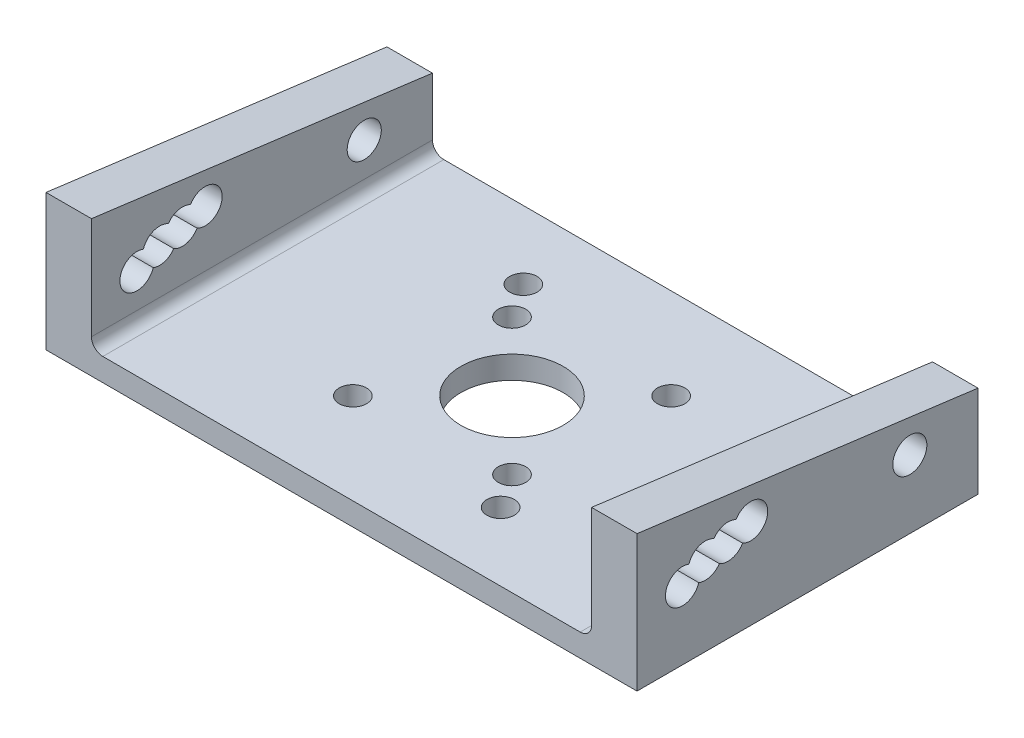
ISO-10303-21;
HEADER;
FILE_DESCRIPTION(('STEP AP214'),'2;1');
FILE_NAME('part.step','',(''),(''),'','','');
FILE_SCHEMA(('AUTOMOTIVE_DESIGN { 1 0 10303 214 1 1 1 1 }'));
ENDSEC;
DATA;
#1=APPLICATION_CONTEXT('core data for automotive mechanical design processes');
#2=APPLICATION_PROTOCOL_DEFINITION('international standard','automotive_design',2000,#1);
#3=PRODUCT_CONTEXT('',#1,'mechanical');
#4=PRODUCT('Part','Part','',(#3));
#5=PRODUCT_RELATED_PRODUCT_CATEGORY('part','',(#4));
#6=PRODUCT_DEFINITION_FORMATION('','',#4);
#7=PRODUCT_DEFINITION_CONTEXT('part definition',#1,'design');
#8=PRODUCT_DEFINITION('design','',#6,#7);
#9=PRODUCT_DEFINITION_SHAPE('','',#8);
#10=(LENGTH_UNIT() NAMED_UNIT(*) SI_UNIT(.MILLI.,.METRE.));
#11=(NAMED_UNIT(*) PLANE_ANGLE_UNIT() SI_UNIT($,.RADIAN.));
#12=(NAMED_UNIT(*) SI_UNIT($,.STERADIAN.) SOLID_ANGLE_UNIT());
#13=UNCERTAINTY_MEASURE_WITH_UNIT(LENGTH_MEASURE(1.E-05),#10,'distance_accuracy_value','');
#14=(GEOMETRIC_REPRESENTATION_CONTEXT(3) GLOBAL_UNCERTAINTY_ASSIGNED_CONTEXT((#13)) GLOBAL_UNIT_ASSIGNED_CONTEXT((#10,
#11,#12)) REPRESENTATION_CONTEXT('',''));
#15=CARTESIAN_POINT('',(0.,0.,0.));
#16=DIRECTION('',(0.,0.,1.));
#17=DIRECTION('',(1.,0.,0.));
#18=AXIS2_PLACEMENT_3D('',#15,#16,#17);
#19=CARTESIAN_POINT('',(0.,2.,0.));
#20=DIRECTION('',(0.,-1.,0.));
#21=DIRECTION('',(0.,0.,-1.));
#22=AXIS2_PLACEMENT_3D('',#19,#20,#21);
#23=PLANE('',#22);
#24=CARTESIAN_POINT('',(6.,2.,6.));
#25=DIRECTION('',(0.,1.,0.));
#26=DIRECTION('',(0.,0.,1.));
#27=AXIS2_PLACEMENT_3D('',#24,#25,#26);
#28=CIRCLE('',#27,1.2058376326813);
#29=CARTESIAN_POINT('',(6.,2.,7.2058376326813));
#30=VERTEX_POINT('',#29);
#31=EDGE_CURVE('E326',#30,#30,#28,.T.);
#32=ORIENTED_EDGE('',*,*,#31,.F.);
#33=EDGE_LOOP('',(#32));
#34=FACE_BOUND('',#33,.T.);
#35=CARTESIAN_POINT('',(-8.,2.,-9.));
#36=DIRECTION('',(0.,1.,0.));
#37=DIRECTION('',(0.,0.,1.));
#38=AXIS2_PLACEMENT_3D('',#35,#36,#37);
#39=CIRCLE('',#38,1.2058376326813);
#40=CARTESIAN_POINT('',(-8.,2.,-7.79416236731869));
#41=VERTEX_POINT('',#40);
#42=EDGE_CURVE('E338',#41,#41,#39,.T.);
#43=ORIENTED_EDGE('',*,*,#42,.F.);
#44=EDGE_LOOP('',(#43));
#45=FACE_BOUND('',#44,.T.);
#46=CARTESIAN_POINT('',(7.,2.,-7.));
#47=DIRECTION('',(0.,1.,0.));
#48=DIRECTION('',(0.,0.,1.));
#49=AXIS2_PLACEMENT_3D('',#46,#47,#48);
#50=CIRCLE('',#49,1.20583763268131);
#51=CARTESIAN_POINT('',(7.,2.,-5.79416236731869));
#52=VERTEX_POINT('',#51);
#53=EDGE_CURVE('E350',#52,#52,#50,.T.);
#54=ORIENTED_EDGE('',*,*,#53,.F.);
#55=EDGE_LOOP('',(#54));
#56=FACE_BOUND('',#55,.T.);
#57=CARTESIAN_POINT('',(0.,2.,0.));
#58=DIRECTION('',(0.,1.,0.));
#59=DIRECTION('',(0.,0.,1.));
#60=AXIS2_PLACEMENT_3D('',#57,#58,#59);
#61=CIRCLE('',#60,4.5);
#62=CARTESIAN_POINT('',(0.,2.,4.5));
#63=VERTEX_POINT('',#62);
#64=EDGE_CURVE('E356',#63,#63,#61,.T.);
#65=ORIENTED_EDGE('',*,*,#64,.F.);
#66=EDGE_LOOP('',(#65));
#67=FACE_BOUND('',#66,.T.);
#68=CARTESIAN_POINT('',(-6.,2.,-6.));
#69=DIRECTION('',(0.,1.,0.));
#70=DIRECTION('',(0.,0.,1.));
#71=AXIS2_PLACEMENT_3D('',#68,#69,#70);
#72=CIRCLE('',#71,1.2058376326813);
#73=CARTESIAN_POINT('',(-6.,2.,-4.7941623673187));
#74=VERTEX_POINT('',#73);
#75=EDGE_CURVE('E344',#74,#74,#72,.T.);
#76=ORIENTED_EDGE('',*,*,#75,.F.);
#77=EDGE_LOOP('',(#76));
#78=FACE_BOUND('',#77,.T.);
#79=CARTESIAN_POINT('',(-7.,2.,7.));
#80=DIRECTION('',(0.,1.,0.));
#81=DIRECTION('',(0.,0.,1.));
#82=AXIS2_PLACEMENT_3D('',#79,#80,#81);
#83=CIRCLE('',#82,1.2058376326813);
#84=CARTESIAN_POINT('',(-7.,2.,8.2058376326813));
#85=VERTEX_POINT('',#84);
#86=EDGE_CURVE('E332',#85,#85,#83,.T.);
#87=ORIENTED_EDGE('',*,*,#86,.F.);
#88=EDGE_LOOP('',(#87));
#89=FACE_BOUND('',#88,.T.);
#90=CARTESIAN_POINT('',(8.,2.,9.));
#91=DIRECTION('',(0.,1.,0.));
#92=DIRECTION('',(0.,0.,1.));
#93=AXIS2_PLACEMENT_3D('',#90,#91,#92);
#94=CIRCLE('',#93,1.20583763268131);
#95=CARTESIAN_POINT('',(8.,2.,10.2058376326813));
#96=VERTEX_POINT('',#95);
#97=EDGE_CURVE('E320',#96,#96,#94,.T.);
#98=ORIENTED_EDGE('',*,*,#97,.F.);
#99=EDGE_LOOP('',(#98));
#100=FACE_BOUND('',#99,.T.);
#101=DIRECTION('',(1.,0.,0.));
#102=VECTOR('',#101,1.);
#103=CARTESIAN_POINT('',(-26.,2.,15.));
#104=LINE('',#103,#102);
#105=CARTESIAN_POINT('',(-21.,2.,15.));
#106=VERTEX_POINT('',#105);
#107=CARTESIAN_POINT('',(21.,2.,15.));
#108=VERTEX_POINT('',#107);
#109=EDGE_CURVE('E371',#106,#108,#104,.T.);
#110=ORIENTED_EDGE('',*,*,#109,.T.);
#111=DIRECTION('',(0.,0.,-1.));
#112=VECTOR('',#111,1.);
#113=CARTESIAN_POINT('',(21.,2.,-15.));
#114=LINE('',#113,#112);
#115=CARTESIAN_POINT('',(21.,2.,-15.));
#116=VERTEX_POINT('',#115);
#117=EDGE_CURVE('E380',#108,#116,#114,.T.);
#118=ORIENTED_EDGE('',*,*,#117,.T.);
#119=DIRECTION('',(-1.,0.,0.));
#120=VECTOR('',#119,1.);
#121=CARTESIAN_POINT('',(-26.,2.,-15.));
#122=LINE('',#121,#120);
#123=CARTESIAN_POINT('',(-21.,2.,-15.));
#124=VERTEX_POINT('',#123);
#125=EDGE_CURVE('E367',#116,#124,#122,.T.);
#126=ORIENTED_EDGE('',*,*,#125,.T.);
#127=DIRECTION('',(0.,0.,-1.));
#128=VECTOR('',#127,1.);
#129=CARTESIAN_POINT('',(-21.,2.,15.));
#130=LINE('',#129,#128);
#131=EDGE_CURVE('E378',#124,#106,#130,.F.);
#132=ORIENTED_EDGE('',*,*,#131,.T.);
#133=EDGE_LOOP('',(#110,#118,#126,#132));
#134=FACE_BOUND('',#133,.T.);
#135=ADVANCED_FACE('F35',(#34,#45,#56,#67,#78,#89,#100,#134),#23,.F.);
#136=CARTESIAN_POINT('',(0.,0.,0.));
#137=DIRECTION('',(0.,-1.,0.));
#138=DIRECTION('',(0.,0.,-1.));
#139=AXIS2_PLACEMENT_3D('',#136,#137,#138);
#140=PLANE('',#139);
#141=CARTESIAN_POINT('',(6.,0.,6.));
#142=DIRECTION('',(0.,1.,0.));
#143=DIRECTION('',(0.,0.,1.));
#144=AXIS2_PLACEMENT_3D('',#141,#142,#143);
#145=CIRCLE('',#144,1.2058376326813);
#146=CARTESIAN_POINT('',(6.,0.,7.2058376326813));
#147=VERTEX_POINT('',#146);
#148=EDGE_CURVE('E323',#147,#147,#145,.T.);
#149=ORIENTED_EDGE('',*,*,#148,.T.);
#150=EDGE_LOOP('',(#149));
#151=FACE_BOUND('',#150,.T.);
#152=CARTESIAN_POINT('',(-8.,0.,-9.));
#153=DIRECTION('',(0.,1.,0.));
#154=DIRECTION('',(0.,0.,1.));
#155=AXIS2_PLACEMENT_3D('',#152,#153,#154);
#156=CIRCLE('',#155,1.2058376326813);
#157=CARTESIAN_POINT('',(-8.,0.,-7.79416236731869));
#158=VERTEX_POINT('',#157);
#159=EDGE_CURVE('E335',#158,#158,#156,.T.);
#160=ORIENTED_EDGE('',*,*,#159,.T.);
#161=EDGE_LOOP('',(#160));
#162=FACE_BOUND('',#161,.T.);
#163=CARTESIAN_POINT('',(7.,0.,-7.));
#164=DIRECTION('',(0.,1.,0.));
#165=DIRECTION('',(0.,0.,1.));
#166=AXIS2_PLACEMENT_3D('',#163,#164,#165);
#167=CIRCLE('',#166,1.20583763268131);
#168=CARTESIAN_POINT('',(7.,0.,-5.79416236731869));
#169=VERTEX_POINT('',#168);
#170=EDGE_CURVE('E347',#169,#169,#167,.T.);
#171=ORIENTED_EDGE('',*,*,#170,.T.);
#172=EDGE_LOOP('',(#171));
#173=FACE_BOUND('',#172,.T.);
#174=DIRECTION('',(0.,0.,-1.));
#175=VECTOR('',#174,1.);
#176=CARTESIAN_POINT('',(26.,0.,15.));
#177=LINE('',#176,#175);
#178=CARTESIAN_POINT('',(26.,0.,15.));
#179=VERTEX_POINT('',#178);
#180=CARTESIAN_POINT('',(26.,0.,-15.));
#181=VERTEX_POINT('',#180);
#182=EDGE_CURVE('E359',#179,#181,#177,.T.);
#183=ORIENTED_EDGE('',*,*,#182,.F.);
#184=DIRECTION('',(1.,0.,0.));
#185=VECTOR('',#184,1.);
#186=CARTESIAN_POINT('',(-26.,0.,15.));
#187=LINE('',#186,#185);
#188=CARTESIAN_POINT('',(-26.,0.,15.));
#189=VERTEX_POINT('',#188);
#190=EDGE_CURVE('E372',#189,#179,#187,.T.);
#191=ORIENTED_EDGE('',*,*,#190,.F.);
#192=DIRECTION('',(0.,0.,1.));
#193=VECTOR('',#192,1.);
#194=CARTESIAN_POINT('',(-26.,0.,15.));
#195=LINE('',#194,#193);
#196=CARTESIAN_POINT('',(-26.,0.,-15.));
#197=VERTEX_POINT('',#196);
#198=EDGE_CURVE('E438',#197,#189,#195,.T.);
#199=ORIENTED_EDGE('',*,*,#198,.F.);
#200=DIRECTION('',(-1.,0.,0.));
#201=VECTOR('',#200,1.);
#202=CARTESIAN_POINT('',(-26.,0.,-15.));
#203=LINE('',#202,#201);
#204=EDGE_CURVE('E440',#181,#197,#203,.T.);
#205=ORIENTED_EDGE('',*,*,#204,.F.);
#206=EDGE_LOOP('',(#183,#191,#199,#205));
#207=FACE_BOUND('',#206,.T.);
#208=CARTESIAN_POINT('',(0.,0.,0.));
#209=DIRECTION('',(0.,1.,0.));
#210=DIRECTION('',(0.,0.,1.));
#211=AXIS2_PLACEMENT_3D('',#208,#209,#210);
#212=CIRCLE('',#211,4.5);
#213=CARTESIAN_POINT('',(0.,0.,4.5));
#214=VERTEX_POINT('',#213);
#215=EDGE_CURVE('E353',#214,#214,#212,.T.);
#216=ORIENTED_EDGE('',*,*,#215,.T.);
#217=EDGE_LOOP('',(#216));
#218=FACE_BOUND('',#217,.T.);
#219=CARTESIAN_POINT('',(-6.,0.,-6.));
#220=DIRECTION('',(0.,1.,0.));
#221=DIRECTION('',(0.,0.,1.));
#222=AXIS2_PLACEMENT_3D('',#219,#220,#221);
#223=CIRCLE('',#222,1.2058376326813);
#224=CARTESIAN_POINT('',(-6.,0.,-4.7941623673187));
#225=VERTEX_POINT('',#224);
#226=EDGE_CURVE('E341',#225,#225,#223,.T.);
#227=ORIENTED_EDGE('',*,*,#226,.T.);
#228=EDGE_LOOP('',(#227));
#229=FACE_BOUND('',#228,.T.);
#230=CARTESIAN_POINT('',(-7.,0.,7.));
#231=DIRECTION('',(0.,1.,0.));
#232=DIRECTION('',(0.,0.,1.));
#233=AXIS2_PLACEMENT_3D('',#230,#231,#232);
#234=CIRCLE('',#233,1.2058376326813);
#235=CARTESIAN_POINT('',(-7.,0.,8.2058376326813));
#236=VERTEX_POINT('',#235);
#237=EDGE_CURVE('E329',#236,#236,#234,.T.);
#238=ORIENTED_EDGE('',*,*,#237,.T.);
#239=EDGE_LOOP('',(#238));
#240=FACE_BOUND('',#239,.T.);
#241=CARTESIAN_POINT('',(8.,0.,9.));
#242=DIRECTION('',(0.,1.,0.));
#243=DIRECTION('',(0.,0.,1.));
#244=AXIS2_PLACEMENT_3D('',#241,#242,#243);
#245=CIRCLE('',#244,1.20583763268131);
#246=CARTESIAN_POINT('',(8.,0.,10.2058376326813));
#247=VERTEX_POINT('',#246);
#248=EDGE_CURVE('E297',#247,#247,#245,.T.);
#249=ORIENTED_EDGE('',*,*,#248,.T.);
#250=EDGE_LOOP('',(#249));
#251=FACE_BOUND('',#250,.T.);
#252=ADVANCED_FACE('F442',(#151,#162,#173,#207,#218,#229,#240,#251),#140,.T.);
#253=CARTESIAN_POINT('',(26.,2.,15.));
#254=DIRECTION('',(-1.,0.,0.));
#255=DIRECTION('',(0.,0.,1.));
#256=AXIS2_PLACEMENT_3D('',#253,#254,#255);
#257=PLANE('',#256);
#258=ORIENTED_EDGE('',*,*,#182,.T.);
#259=DIRECTION('',(0.,-1.,0.));
#260=VECTOR('',#259,1.);
#261=CARTESIAN_POINT('',(26.,2.,-15.));
#262=LINE('',#261,#260);
#263=CARTESIAN_POINT('',(26.,8.08944509942933,-15.));
#264=VERTEX_POINT('',#263);
#265=EDGE_CURVE('E381',#264,#181,#262,.T.);
#266=ORIENTED_EDGE('',*,*,#265,.F.);
#267=DIRECTION('',(0.,0.129258302982044,0.99161095753839));
#268=VECTOR('',#267,1.);
#269=CARTESIAN_POINT('',(26.,9.87689824947524,-1.28747176173078));
#270=LINE('',#269,#268);
#271=CARTESIAN_POINT('',(26.,12.,15.));
#272=VERTEX_POINT('',#271);
#273=EDGE_CURVE('E211',#264,#272,#270,.T.);
#274=ORIENTED_EDGE('',*,*,#273,.T.);
#275=DIRECTION('',(0.,-1.,0.));
#276=VECTOR('',#275,1.);
#277=CARTESIAN_POINT('',(26.,2.,15.));
#278=LINE('',#277,#276);
#279=EDGE_CURVE('E377',#272,#179,#278,.T.);
#280=ORIENTED_EDGE('',*,*,#279,.T.);
#281=EDGE_LOOP('',(#258,#266,#274,#280));
#282=FACE_BOUND('',#281,.T.);
#283=CARTESIAN_POINT('',(26.,6.,11.));
#284=DIRECTION('',(-1.,0.,0.));
#285=DIRECTION('',(0.,0.,1.));
#286=AXIS2_PLACEMENT_3D('',#283,#284,#285);
#287=CIRCLE('',#286,1.5);
#288=CARTESIAN_POINT('',(26.,5.55190263226596,9.568494237165));
#289=VERTEX_POINT('',#288);
#290=CARTESIAN_POINT('',(26.,7.38809736773404,10.431505762835));
#291=VERTEX_POINT('',#290);
#292=EDGE_CURVE('E232',#289,#291,#287,.T.);
#293=ORIENTED_EDGE('',*,*,#292,.T.);
#294=CARTESIAN_POINT('',(26.,6.94,9.));
#295=DIRECTION('',(-1.,0.,0.));
#296=DIRECTION('',(0.,0.,1.));
#297=AXIS2_PLACEMENT_3D('',#294,#295,#296);
#298=CIRCLE('',#297,1.5);
#299=CARTESIAN_POINT('',(26.,8.23344859091753,8.24040093295645));
#300=VERTEX_POINT('',#299);
#301=EDGE_CURVE('E188',#291,#300,#298,.T.);
#302=ORIENTED_EDGE('',*,*,#301,.T.);
#303=CARTESIAN_POINT('',(26.,7.39,7.));
#304=DIRECTION('',(-1.,0.,0.));
#305=DIRECTION('',(0.,0.,1.));
#306=AXIS2_PLACEMENT_3D('',#303,#304,#305);
#307=CIRCLE('',#306,1.5);
#308=CARTESIAN_POINT('',(26.,8.71231680996912,6.29184870679136));
#309=VERTEX_POINT('',#308);
#310=EDGE_CURVE('E235',#300,#309,#307,.T.);
#311=ORIENTED_EDGE('',*,*,#310,.T.);
#312=CARTESIAN_POINT('',(26.,7.95,5.));
#313=DIRECTION('',(-1.,0.,0.));
#314=DIRECTION('',(0.,0.,1.));
#315=AXIS2_PLACEMENT_3D('',#312,#313,#314);
#316=CIRCLE('',#315,1.5);
#317=CARTESIAN_POINT('',(26.,6.62768319003088,5.70815129320865));
#318=VERTEX_POINT('',#317);
#319=EDGE_CURVE('E239',#309,#318,#316,.T.);
#320=ORIENTED_EDGE('',*,*,#319,.T.);
#321=CARTESIAN_POINT('',(26.,6.09655140908246,7.75959906704356));
#322=VERTEX_POINT('',#321);
#323=EDGE_CURVE('E240',#318,#322,#307,.T.);
#324=ORIENTED_EDGE('',*,*,#323,.T.);
#325=EDGE_CURVE('E236',#322,#289,#298,.T.);
#326=ORIENTED_EDGE('',*,*,#325,.T.);
#327=EDGE_LOOP('',(#293,#302,#311,#320,#324,#326));
#328=FACE_BOUND('',#327,.T.);
#329=CARTESIAN_POINT('',(26.,6.,-9.));
#330=DIRECTION('',(-1.,0.,0.));
#331=DIRECTION('',(0.,0.,1.));
#332=AXIS2_PLACEMENT_3D('',#329,#330,#331);
#333=CIRCLE('',#332,1.5);
#334=CARTESIAN_POINT('',(26.,6.,-7.5));
#335=VERTEX_POINT('',#334);
#336=EDGE_CURVE('E214',#335,#335,#333,.T.);
#337=ORIENTED_EDGE('',*,*,#336,.T.);
#338=EDGE_LOOP('',(#337));
#339=FACE_BOUND('',#338,.T.);
#340=ADVANCED_FACE('F423',(#282,#328,#339),#257,.F.);
#341=CARTESIAN_POINT('',(-26.,2.,-15.));
#342=DIRECTION('',(0.,0.,1.));
#343=DIRECTION('',(1.,0.,0.));
#344=AXIS2_PLACEMENT_3D('',#341,#342,#343);
#345=PLANE('',#344);
#346=ORIENTED_EDGE('',*,*,#204,.T.);
#347=DIRECTION('',(0.,-1.,0.));
#348=VECTOR('',#347,1.);
#349=CARTESIAN_POINT('',(-26.,2.,-15.));
#350=LINE('',#349,#348);
#351=CARTESIAN_POINT('',(-26.,8.08944509942933,-15.));
#352=VERTEX_POINT('',#351);
#353=EDGE_CURVE('E427',#352,#197,#350,.T.);
#354=ORIENTED_EDGE('',*,*,#353,.F.);
#355=DIRECTION('',(-1.,0.,0.));
#356=VECTOR('',#355,1.);
#357=CARTESIAN_POINT('',(-22.,8.08944509942933,-15.));
#358=LINE('',#357,#356);
#359=CARTESIAN_POINT('',(-22.,8.08944509942933,-15.));
#360=VERTEX_POINT('',#359);
#361=EDGE_CURVE('E298',#360,#352,#358,.T.);
#362=ORIENTED_EDGE('',*,*,#361,.F.);
#363=DIRECTION('',(0.,1.,0.));
#364=VECTOR('',#363,1.);
#365=CARTESIAN_POINT('',(-22.,0.,-15.));
#366=LINE('',#365,#364);
#367=CARTESIAN_POINT('',(-22.,3.,-15.));
#368=VERTEX_POINT('',#367);
#369=EDGE_CURVE('E278',#368,#360,#366,.T.);
#370=ORIENTED_EDGE('',*,*,#369,.F.);
#371=CARTESIAN_POINT('',(-21.,3.,-15.));
#372=DIRECTION('',(0.,0.,1.));
#373=DIRECTION('',(1.,0.,0.));
#374=AXIS2_PLACEMENT_3D('',#371,#372,#373);
#375=CIRCLE('',#374,1.);
#376=EDGE_CURVE('E43',#368,#124,#375,.T.);
#377=ORIENTED_EDGE('',*,*,#376,.T.);
#378=ORIENTED_EDGE('',*,*,#125,.F.);
#379=CARTESIAN_POINT('',(21.,3.,-15.));
#380=DIRECTION('',(0.,0.,1.));
#381=DIRECTION('',(1.,0.,0.));
#382=AXIS2_PLACEMENT_3D('',#379,#380,#381);
#383=CIRCLE('',#382,1.);
#384=CARTESIAN_POINT('',(22.,3.,-15.));
#385=VERTEX_POINT('',#384);
#386=EDGE_CURVE('E398',#116,#385,#383,.T.);
#387=ORIENTED_EDGE('',*,*,#386,.T.);
#388=DIRECTION('',(0.,1.,0.));
#389=VECTOR('',#388,1.);
#390=CARTESIAN_POINT('',(22.,0.,-15.));
#391=LINE('',#390,#389);
#392=CARTESIAN_POINT('',(22.,8.08944509942933,-15.));
#393=VERTEX_POINT('',#392);
#394=EDGE_CURVE('E194',#385,#393,#391,.T.);
#395=ORIENTED_EDGE('',*,*,#394,.T.);
#396=DIRECTION('',(1.,0.,0.));
#397=VECTOR('',#396,1.);
#398=CARTESIAN_POINT('',(22.,8.08944509942933,-15.));
#399=LINE('',#398,#397);
#400=EDGE_CURVE('E245',#393,#264,#399,.T.);
#401=ORIENTED_EDGE('',*,*,#400,.T.);
#402=ORIENTED_EDGE('',*,*,#265,.T.);
#403=EDGE_LOOP('',(#346,#354,#362,#370,#377,#378,#387,#395,#401,#402));
#404=FACE_BOUND('',#403,.T.);
#405=ADVANCED_FACE('F404',(#404),#345,.F.);
#406=CARTESIAN_POINT('',(-26.,2.,15.));
#407=DIRECTION('',(1.,0.,0.));
#408=DIRECTION('',(0.,0.,-1.));
#409=AXIS2_PLACEMENT_3D('',#406,#407,#408);
#410=PLANE('',#409);
#411=ORIENTED_EDGE('',*,*,#198,.T.);
#412=DIRECTION('',(0.,-1.,0.));
#413=VECTOR('',#412,1.);
#414=CARTESIAN_POINT('',(-26.,2.,15.));
#415=LINE('',#414,#413);
#416=CARTESIAN_POINT('',(-26.,12.,15.));
#417=VERTEX_POINT('',#416);
#418=EDGE_CURVE('E429',#417,#189,#415,.T.);
#419=ORIENTED_EDGE('',*,*,#418,.F.);
#420=DIRECTION('',(0.,0.129258302982044,0.99161095753839));
#421=VECTOR('',#420,1.);
#422=CARTESIAN_POINT('',(-26.,9.87689824947524,-1.28747176173078));
#423=LINE('',#422,#421);
#424=EDGE_CURVE('E264',#352,#417,#423,.T.);
#425=ORIENTED_EDGE('',*,*,#424,.F.);
#426=ORIENTED_EDGE('',*,*,#353,.T.);
#427=EDGE_LOOP('',(#411,#419,#425,#426));
#428=FACE_BOUND('',#427,.T.);
#429=CARTESIAN_POINT('',(-26.,6.,11.));
#430=DIRECTION('',(-1.,0.,0.));
#431=DIRECTION('',(0.,0.,1.));
#432=AXIS2_PLACEMENT_3D('',#429,#430,#431);
#433=CIRCLE('',#432,1.5);
#434=CARTESIAN_POINT('',(-26.,5.55190263226596,9.568494237165));
#435=VERTEX_POINT('',#434);
#436=CARTESIAN_POINT('',(-26.,7.38809736773404,10.431505762835));
#437=VERTEX_POINT('',#436);
#438=EDGE_CURVE('E248',#435,#437,#433,.T.);
#439=ORIENTED_EDGE('',*,*,#438,.F.);
#440=CARTESIAN_POINT('',(-26.,6.94,9.));
#441=DIRECTION('',(-1.,0.,0.));
#442=DIRECTION('',(0.,0.,1.));
#443=AXIS2_PLACEMENT_3D('',#440,#441,#442);
#444=CIRCLE('',#443,1.5);
#445=CARTESIAN_POINT('',(-26.,6.09655140908246,7.75959906704356));
#446=VERTEX_POINT('',#445);
#447=EDGE_CURVE('E281',#446,#435,#444,.T.);
#448=ORIENTED_EDGE('',*,*,#447,.F.);
#449=CARTESIAN_POINT('',(-26.,7.39,7.));
#450=DIRECTION('',(-1.,0.,0.));
#451=DIRECTION('',(0.,0.,1.));
#452=AXIS2_PLACEMENT_3D('',#449,#450,#451);
#453=CIRCLE('',#452,1.5);
#454=CARTESIAN_POINT('',(-26.,6.62768319003088,5.70815129320865));
#455=VERTEX_POINT('',#454);
#456=EDGE_CURVE('E283',#455,#446,#453,.T.);
#457=ORIENTED_EDGE('',*,*,#456,.F.);
#458=CARTESIAN_POINT('',(-26.,7.95,5.));
#459=DIRECTION('',(-1.,0.,0.));
#460=DIRECTION('',(0.,0.,1.));
#461=AXIS2_PLACEMENT_3D('',#458,#459,#460);
#462=CIRCLE('',#461,1.5);
#463=CARTESIAN_POINT('',(-26.,8.71231680996912,6.29184870679136));
#464=VERTEX_POINT('',#463);
#465=EDGE_CURVE('E286',#464,#455,#462,.T.);
#466=ORIENTED_EDGE('',*,*,#465,.F.);
#467=CARTESIAN_POINT('',(-26.,8.23344859091753,8.24040093295645));
#468=VERTEX_POINT('',#467);
#469=EDGE_CURVE('E287',#468,#464,#453,.T.);
#470=ORIENTED_EDGE('',*,*,#469,.F.);
#471=EDGE_CURVE('E284',#437,#468,#444,.T.);
#472=ORIENTED_EDGE('',*,*,#471,.F.);
#473=EDGE_LOOP('',(#439,#448,#457,#466,#470,#472));
#474=FACE_BOUND('',#473,.T.);
#475=CARTESIAN_POINT('',(-26.,6.,-9.));
#476=DIRECTION('',(-1.,0.,0.));
#477=DIRECTION('',(0.,0.,1.));
#478=AXIS2_PLACEMENT_3D('',#475,#476,#477);
#479=CIRCLE('',#478,1.5);
#480=CARTESIAN_POINT('',(-26.,6.,-7.5));
#481=VERTEX_POINT('',#480);
#482=EDGE_CURVE('E289',#481,#481,#479,.T.);
#483=ORIENTED_EDGE('',*,*,#482,.F.);
#484=EDGE_LOOP('',(#483));
#485=FACE_BOUND('',#484,.T.);
#486=ADVANCED_FACE('F445',(#428,#474,#485),#410,.F.);
#487=CARTESIAN_POINT('',(-26.,2.,15.));
#488=DIRECTION('',(0.,0.,-1.));
#489=DIRECTION('',(-1.,0.,0.));
#490=AXIS2_PLACEMENT_3D('',#487,#488,#489);
#491=PLANE('',#490);
#492=ORIENTED_EDGE('',*,*,#190,.T.);
#493=ORIENTED_EDGE('',*,*,#279,.F.);
#494=DIRECTION('',(1.,0.,0.));
#495=VECTOR('',#494,1.);
#496=CARTESIAN_POINT('',(22.,12.,15.));
#497=LINE('',#496,#495);
#498=CARTESIAN_POINT('',(22.,12.,15.));
#499=VERTEX_POINT('',#498);
#500=EDGE_CURVE('E249',#499,#272,#497,.T.);
#501=ORIENTED_EDGE('',*,*,#500,.F.);
#502=DIRECTION('',(0.,-1.,0.));
#503=VECTOR('',#502,1.);
#504=CARTESIAN_POINT('',(22.,0.,15.));
#505=LINE('',#504,#503);
#506=CARTESIAN_POINT('',(22.,3.,15.));
#507=VERTEX_POINT('',#506);
#508=EDGE_CURVE('E228',#499,#507,#505,.T.);
#509=ORIENTED_EDGE('',*,*,#508,.T.);
#510=CARTESIAN_POINT('',(21.,3.,15.));
#511=DIRECTION('',(0.,0.,-1.));
#512=DIRECTION('',(-1.,0.,0.));
#513=AXIS2_PLACEMENT_3D('',#510,#511,#512);
#514=CIRCLE('',#513,1.);
#515=EDGE_CURVE('E399',#507,#108,#514,.T.);
#516=ORIENTED_EDGE('',*,*,#515,.T.);
#517=ORIENTED_EDGE('',*,*,#109,.F.);
#518=CARTESIAN_POINT('',(-21.,3.,15.));
#519=DIRECTION('',(0.,0.,-1.));
#520=DIRECTION('',(-1.,0.,0.));
#521=AXIS2_PLACEMENT_3D('',#518,#519,#520);
#522=CIRCLE('',#521,1.);
#523=CARTESIAN_POINT('',(-22.,3.,15.));
#524=VERTEX_POINT('',#523);
#525=EDGE_CURVE('E11',#106,#524,#522,.T.);
#526=ORIENTED_EDGE('',*,*,#525,.T.);
#527=DIRECTION('',(0.,-1.,0.));
#528=VECTOR('',#527,1.);
#529=CARTESIAN_POINT('',(-22.,0.,15.));
#530=LINE('',#529,#528);
#531=CARTESIAN_POINT('',(-22.,12.,15.));
#532=VERTEX_POINT('',#531);
#533=EDGE_CURVE('E319',#532,#524,#530,.T.);
#534=ORIENTED_EDGE('',*,*,#533,.F.);
#535=DIRECTION('',(-1.,0.,0.));
#536=VECTOR('',#535,1.);
#537=CARTESIAN_POINT('',(-22.,12.,15.));
#538=LINE('',#537,#536);
#539=EDGE_CURVE('E294',#532,#417,#538,.T.);
#540=ORIENTED_EDGE('',*,*,#539,.T.);
#541=ORIENTED_EDGE('',*,*,#418,.T.);
#542=EDGE_LOOP('',(#492,#493,#501,#509,#516,#517,#526,#534,#540,#541));
#543=FACE_BOUND('',#542,.T.);
#544=ADVANCED_FACE('F415',(#543),#491,.F.);
#545=CARTESIAN_POINT('',(0.,2.,0.));
#546=DIRECTION('',(0.,-1.,0.));
#547=DIRECTION('',(0.,0.,-1.));
#548=AXIS2_PLACEMENT_3D('',#545,#546,#547);
#549=CYLINDRICAL_SURFACE('',#548,4.5);
#550=ORIENTED_EDGE('',*,*,#64,.T.);
#551=EDGE_LOOP('',(#550));
#552=FACE_BOUND('',#551,.T.);
#553=ORIENTED_EDGE('',*,*,#215,.F.);
#554=EDGE_LOOP('',(#553));
#555=FACE_BOUND('',#554,.T.);
#556=ADVANCED_FACE('F476',(#552,#555),#549,.F.);
#557=CARTESIAN_POINT('',(7.,2.,-7.));
#558=DIRECTION('',(0.,-1.,0.));
#559=DIRECTION('',(0.,0.,-1.));
#560=AXIS2_PLACEMENT_3D('',#557,#558,#559);
#561=CYLINDRICAL_SURFACE('',#560,1.20583763268131);
#562=ORIENTED_EDGE('',*,*,#53,.T.);
#563=EDGE_LOOP('',(#562));
#564=FACE_BOUND('',#563,.T.);
#565=ORIENTED_EDGE('',*,*,#170,.F.);
#566=EDGE_LOOP('',(#565));
#567=FACE_BOUND('',#566,.T.);
#568=ADVANCED_FACE('F563',(#564,#567),#561,.F.);
#569=CARTESIAN_POINT('',(-6.,2.,-6.));
#570=DIRECTION('',(0.,-1.,0.));
#571=DIRECTION('',(0.,0.,-1.));
#572=AXIS2_PLACEMENT_3D('',#569,#570,#571);
#573=CYLINDRICAL_SURFACE('',#572,1.2058376326813);
#574=ORIENTED_EDGE('',*,*,#75,.T.);
#575=EDGE_LOOP('',(#574));
#576=FACE_BOUND('',#575,.T.);
#577=ORIENTED_EDGE('',*,*,#226,.F.);
#578=EDGE_LOOP('',(#577));
#579=FACE_BOUND('',#578,.T.);
#580=ADVANCED_FACE('F560',(#576,#579),#573,.F.);
#581=CARTESIAN_POINT('',(-8.,2.,-9.));
#582=DIRECTION('',(0.,-1.,0.));
#583=DIRECTION('',(0.,0.,-1.));
#584=AXIS2_PLACEMENT_3D('',#581,#582,#583);
#585=CYLINDRICAL_SURFACE('',#584,1.2058376326813);
#586=ORIENTED_EDGE('',*,*,#42,.T.);
#587=EDGE_LOOP('',(#586));
#588=FACE_BOUND('',#587,.T.);
#589=ORIENTED_EDGE('',*,*,#159,.F.);
#590=EDGE_LOOP('',(#589));
#591=FACE_BOUND('',#590,.T.);
#592=ADVANCED_FACE('F556',(#588,#591),#585,.F.);
#593=CARTESIAN_POINT('',(-7.,2.,7.));
#594=DIRECTION('',(0.,-1.,0.));
#595=DIRECTION('',(0.,0.,-1.));
#596=AXIS2_PLACEMENT_3D('',#593,#594,#595);
#597=CYLINDRICAL_SURFACE('',#596,1.2058376326813);
#598=ORIENTED_EDGE('',*,*,#86,.T.);
#599=EDGE_LOOP('',(#598));
#600=FACE_BOUND('',#599,.T.);
#601=ORIENTED_EDGE('',*,*,#237,.F.);
#602=EDGE_LOOP('',(#601));
#603=FACE_BOUND('',#602,.T.);
#604=ADVANCED_FACE('F552',(#600,#603),#597,.F.);
#605=CARTESIAN_POINT('',(6.,2.,6.));
#606=DIRECTION('',(0.,-1.,0.));
#607=DIRECTION('',(0.,0.,-1.));
#608=AXIS2_PLACEMENT_3D('',#605,#606,#607);
#609=CYLINDRICAL_SURFACE('',#608,1.2058376326813);
#610=ORIENTED_EDGE('',*,*,#31,.T.);
#611=EDGE_LOOP('',(#610));
#612=FACE_BOUND('',#611,.T.);
#613=ORIENTED_EDGE('',*,*,#148,.F.);
#614=EDGE_LOOP('',(#613));
#615=FACE_BOUND('',#614,.T.);
#616=ADVANCED_FACE('F460',(#612,#615),#609,.F.);
#617=CARTESIAN_POINT('',(8.,2.,9.));
#618=DIRECTION('',(0.,-1.,0.));
#619=DIRECTION('',(0.,0.,-1.));
#620=AXIS2_PLACEMENT_3D('',#617,#618,#619);
#621=CYLINDRICAL_SURFACE('',#620,1.20583763268131);
#622=ORIENTED_EDGE('',*,*,#97,.T.);
#623=EDGE_LOOP('',(#622));
#624=FACE_BOUND('',#623,.T.);
#625=ORIENTED_EDGE('',*,*,#248,.F.);
#626=EDGE_LOOP('',(#625));
#627=FACE_BOUND('',#626,.T.);
#628=ADVANCED_FACE('F451',(#624,#627),#621,.F.);
#629=CARTESIAN_POINT('',(-22.,9.87689824947524,-1.28747176173078));
#630=DIRECTION('',(0.,-0.99161095753839,0.129258302982044));
#631=DIRECTION('',(0.,-0.129258302982044,-0.99161095753839));
#632=AXIS2_PLACEMENT_3D('',#629,#630,#631);
#633=PLANE('',#632);
#634=ORIENTED_EDGE('',*,*,#424,.T.);
#635=ORIENTED_EDGE('',*,*,#539,.F.);
#636=DIRECTION('',(0.,0.129258302982044,0.99161095753839));
#637=VECTOR('',#636,1.);
#638=CARTESIAN_POINT('',(-22.,9.87689824947524,-1.28747176173078));
#639=LINE('',#638,#637);
#640=EDGE_CURVE('E275',#360,#532,#639,.T.);
#641=ORIENTED_EDGE('',*,*,#640,.F.);
#642=ORIENTED_EDGE('',*,*,#361,.T.);
#643=EDGE_LOOP('',(#634,#635,#641,#642));
#644=FACE_BOUND('',#643,.T.);
#645=ADVANCED_FACE('F448',(#644),#633,.F.);
#646=CARTESIAN_POINT('',(-22.,6.,11.));
#647=DIRECTION('',(-1.,0.,0.));
#648=DIRECTION('',(0.,0.,1.));
#649=AXIS2_PLACEMENT_3D('',#646,#647,#648);
#650=CYLINDRICAL_SURFACE('',#649,1.5);
#651=ORIENTED_EDGE('',*,*,#438,.T.);
#652=DIRECTION('',(-1.,0.,0.));
#653=VECTOR('',#652,1.);
#654=CARTESIAN_POINT('',(-22.,7.38809736773404,10.431505762835));
#655=LINE('',#654,#653);
#656=CARTESIAN_POINT('',(-22.,7.38809736773404,10.431505762835));
#657=VERTEX_POINT('',#656);
#658=EDGE_CURVE('E301',#657,#437,#655,.T.);
#659=ORIENTED_EDGE('',*,*,#658,.F.);
#660=CARTESIAN_POINT('',(-22.,6.,11.));
#661=DIRECTION('',(-1.,0.,0.));
#662=DIRECTION('',(0.,0.,1.));
#663=AXIS2_PLACEMENT_3D('',#660,#661,#662);
#664=CIRCLE('',#663,1.5);
#665=CARTESIAN_POINT('',(-22.,5.55190263226596,9.568494237165));
#666=VERTEX_POINT('',#665);
#667=EDGE_CURVE('E260',#666,#657,#664,.T.);
#668=ORIENTED_EDGE('',*,*,#667,.F.);
#669=DIRECTION('',(-1.,0.,0.));
#670=VECTOR('',#669,1.);
#671=CARTESIAN_POINT('',(-22.,5.55190263226596,9.568494237165));
#672=LINE('',#671,#670);
#673=EDGE_CURVE('E316',#666,#435,#672,.T.);
#674=ORIENTED_EDGE('',*,*,#673,.T.);
#675=EDGE_LOOP('',(#651,#659,#668,#674));
#676=FACE_BOUND('',#675,.T.);
#677=ADVANCED_FACE('F450',(#676),#650,.F.);
#678=CARTESIAN_POINT('',(-22.,6.94,9.));
#679=DIRECTION('',(-1.,0.,0.));
#680=DIRECTION('',(0.,0.,1.));
#681=AXIS2_PLACEMENT_3D('',#678,#679,#680);
#682=CYLINDRICAL_SURFACE('',#681,1.5);
#683=ORIENTED_EDGE('',*,*,#471,.T.);
#684=DIRECTION('',(-1.,0.,0.));
#685=VECTOR('',#684,1.);
#686=CARTESIAN_POINT('',(-22.,8.23344859091753,8.24040093295645));
#687=LINE('',#686,#685);
#688=CARTESIAN_POINT('',(-22.,8.23344859091753,8.24040093295645));
#689=VERTEX_POINT('',#688);
#690=EDGE_CURVE('E304',#689,#468,#687,.T.);
#691=ORIENTED_EDGE('',*,*,#690,.F.);
#692=CARTESIAN_POINT('',(-22.,6.94,9.));
#693=DIRECTION('',(-1.,0.,0.));
#694=DIRECTION('',(0.,0.,1.));
#695=AXIS2_PLACEMENT_3D('',#692,#693,#694);
#696=CIRCLE('',#695,1.5);
#697=EDGE_CURVE('E267',#657,#689,#696,.T.);
#698=ORIENTED_EDGE('',*,*,#697,.F.);
#699=ORIENTED_EDGE('',*,*,#658,.T.);
#700=EDGE_LOOP('',(#683,#691,#698,#699));
#701=FACE_BOUND('',#700,.T.);
#702=ADVANCED_FACE('F457',(#701),#682,.F.);
#703=CARTESIAN_POINT('',(-22.,7.39,7.));
#704=DIRECTION('',(-1.,0.,0.));
#705=DIRECTION('',(0.,0.,1.));
#706=AXIS2_PLACEMENT_3D('',#703,#704,#705);
#707=CYLINDRICAL_SURFACE('',#706,1.5);
#708=ORIENTED_EDGE('',*,*,#469,.T.);
#709=DIRECTION('',(-1.,0.,0.));
#710=VECTOR('',#709,1.);
#711=CARTESIAN_POINT('',(-22.,8.71231680996912,6.29184870679136));
#712=LINE('',#711,#710);
#713=CARTESIAN_POINT('',(-22.,8.71231680996912,6.29184870679136));
#714=VERTEX_POINT('',#713);
#715=EDGE_CURVE('E307',#714,#464,#712,.T.);
#716=ORIENTED_EDGE('',*,*,#715,.F.);
#717=CARTESIAN_POINT('',(-22.,7.39,7.));
#718=DIRECTION('',(-1.,0.,0.));
#719=DIRECTION('',(0.,0.,1.));
#720=AXIS2_PLACEMENT_3D('',#717,#718,#719);
#721=CIRCLE('',#720,1.5);
#722=EDGE_CURVE('E270',#689,#714,#721,.T.);
#723=ORIENTED_EDGE('',*,*,#722,.F.);
#724=ORIENTED_EDGE('',*,*,#690,.T.);
#725=EDGE_LOOP('',(#708,#716,#723,#724));
#726=FACE_BOUND('',#725,.T.);
#727=ADVANCED_FACE('F541',(#726),#707,.F.);
#728=CARTESIAN_POINT('',(-22.,7.95,5.));
#729=DIRECTION('',(-1.,0.,0.));
#730=DIRECTION('',(0.,0.,1.));
#731=AXIS2_PLACEMENT_3D('',#728,#729,#730);
#732=CYLINDRICAL_SURFACE('',#731,1.5);
#733=ORIENTED_EDGE('',*,*,#465,.T.);
#734=DIRECTION('',(-1.,0.,0.));
#735=VECTOR('',#734,1.);
#736=CARTESIAN_POINT('',(-22.,6.62768319003088,5.70815129320865));
#737=LINE('',#736,#735);
#738=CARTESIAN_POINT('',(-22.,6.62768319003088,5.70815129320865));
#739=VERTEX_POINT('',#738);
#740=EDGE_CURVE('E310',#739,#455,#737,.T.);
#741=ORIENTED_EDGE('',*,*,#740,.F.);
#742=CARTESIAN_POINT('',(-22.,7.95,5.));
#743=DIRECTION('',(-1.,0.,0.));
#744=DIRECTION('',(0.,0.,1.));
#745=AXIS2_PLACEMENT_3D('',#742,#743,#744);
#746=CIRCLE('',#745,1.5);
#747=EDGE_CURVE('E269',#714,#739,#746,.T.);
#748=ORIENTED_EDGE('',*,*,#747,.F.);
#749=ORIENTED_EDGE('',*,*,#715,.T.);
#750=EDGE_LOOP('',(#733,#741,#748,#749));
#751=FACE_BOUND('',#750,.T.);
#752=ADVANCED_FACE('F538',(#751),#732,.F.);
#753=ORIENTED_EDGE('',*,*,#456,.T.);
#754=DIRECTION('',(-1.,0.,0.));
#755=VECTOR('',#754,1.);
#756=CARTESIAN_POINT('',(-22.,6.09655140908246,7.75959906704356));
#757=LINE('',#756,#755);
#758=CARTESIAN_POINT('',(-22.,6.09655140908246,7.75959906704356));
#759=VERTEX_POINT('',#758);
#760=EDGE_CURVE('E313',#759,#446,#757,.T.);
#761=ORIENTED_EDGE('',*,*,#760,.F.);
#762=EDGE_CURVE('E266',#739,#759,#721,.T.);
#763=ORIENTED_EDGE('',*,*,#762,.F.);
#764=ORIENTED_EDGE('',*,*,#740,.T.);
#765=EDGE_LOOP('',(#753,#761,#763,#764));
#766=FACE_BOUND('',#765,.T.);
#767=ADVANCED_FACE('F532',(#766),#707,.F.);
#768=CARTESIAN_POINT('',(-22.,6.,-9.));
#769=DIRECTION('',(-1.,0.,0.));
#770=DIRECTION('',(0.,0.,1.));
#771=AXIS2_PLACEMENT_3D('',#768,#769,#770);
#772=CYLINDRICAL_SURFACE('',#771,1.5);
#773=CARTESIAN_POINT('',(-22.,6.,-9.));
#774=DIRECTION('',(-1.,0.,0.));
#775=DIRECTION('',(0.,0.,1.));
#776=AXIS2_PLACEMENT_3D('',#773,#774,#775);
#777=CIRCLE('',#776,1.5);
#778=CARTESIAN_POINT('',(-22.,6.,-7.5));
#779=VERTEX_POINT('',#778);
#780=EDGE_CURVE('E272',#779,#779,#777,.T.);
#781=ORIENTED_EDGE('',*,*,#780,.F.);
#782=EDGE_LOOP('',(#781));
#783=FACE_BOUND('',#782,.T.);
#784=ORIENTED_EDGE('',*,*,#482,.T.);
#785=EDGE_LOOP('',(#784));
#786=FACE_BOUND('',#785,.T.);
#787=ADVANCED_FACE('F522',(#783,#786),#772,.F.);
#788=ORIENTED_EDGE('',*,*,#447,.T.);
#789=ORIENTED_EDGE('',*,*,#673,.F.);
#790=EDGE_CURVE('E263',#759,#666,#696,.T.);
#791=ORIENTED_EDGE('',*,*,#790,.F.);
#792=ORIENTED_EDGE('',*,*,#760,.T.);
#793=EDGE_LOOP('',(#788,#789,#791,#792));
#794=FACE_BOUND('',#793,.T.);
#795=ADVANCED_FACE('F517',(#794),#682,.F.);
#796=CARTESIAN_POINT('',(-22.,0.,0.));
#797=DIRECTION('',(-1.,0.,0.));
#798=DIRECTION('',(0.,0.,1.));
#799=AXIS2_PLACEMENT_3D('',#796,#797,#798);
#800=PLANE('',#799);
#801=ORIENTED_EDGE('',*,*,#667,.T.);
#802=ORIENTED_EDGE('',*,*,#697,.T.);
#803=ORIENTED_EDGE('',*,*,#722,.T.);
#804=ORIENTED_EDGE('',*,*,#747,.T.);
#805=ORIENTED_EDGE('',*,*,#762,.T.);
#806=ORIENTED_EDGE('',*,*,#790,.T.);
#807=EDGE_LOOP('',(#801,#802,#803,#804,#805,#806));
#808=FACE_BOUND('',#807,.T.);
#809=ORIENTED_EDGE('',*,*,#780,.T.);
#810=EDGE_LOOP('',(#809));
#811=FACE_BOUND('',#810,.T.);
#812=ORIENTED_EDGE('',*,*,#533,.T.);
#813=DIRECTION('',(0.,0.,-1.));
#814=VECTOR('',#813,1.);
#815=CARTESIAN_POINT('',(-22.,3.,-15.));
#816=LINE('',#815,#814);
#817=EDGE_CURVE('E386',#524,#368,#816,.T.);
#818=ORIENTED_EDGE('',*,*,#817,.T.);
#819=ORIENTED_EDGE('',*,*,#369,.T.);
#820=ORIENTED_EDGE('',*,*,#640,.T.);
#821=EDGE_LOOP('',(#812,#818,#819,#820));
#822=FACE_BOUND('',#821,.T.);
#823=ADVANCED_FACE('F394',(#808,#811,#822),#800,.F.);
#824=CARTESIAN_POINT('',(22.,9.87689824947524,-1.28747176173078));
#825=DIRECTION('',(0.,0.99161095753839,-0.129258302982044));
#826=DIRECTION('',(0.,0.129258302982044,0.99161095753839));
#827=AXIS2_PLACEMENT_3D('',#824,#825,#826);
#828=PLANE('',#827);
#829=ORIENTED_EDGE('',*,*,#273,.F.);
#830=ORIENTED_EDGE('',*,*,#400,.F.);
#831=DIRECTION('',(0.,0.129258302982044,0.99161095753839));
#832=VECTOR('',#831,1.);
#833=CARTESIAN_POINT('',(22.,9.87689824947524,-1.28747176173078));
#834=LINE('',#833,#832);
#835=EDGE_CURVE('E225',#393,#499,#834,.T.);
#836=ORIENTED_EDGE('',*,*,#835,.T.);
#837=ORIENTED_EDGE('',*,*,#500,.T.);
#838=EDGE_LOOP('',(#829,#830,#836,#837));
#839=FACE_BOUND('',#838,.T.);
#840=ADVANCED_FACE('F419',(#839),#828,.T.);
#841=CARTESIAN_POINT('',(22.,6.,11.));
#842=DIRECTION('',(1.,0.,0.));
#843=DIRECTION('',(0.,0.,-1.));
#844=AXIS2_PLACEMENT_3D('',#841,#842,#843);
#845=CYLINDRICAL_SURFACE('',#844,1.5);
#846=ORIENTED_EDGE('',*,*,#292,.F.);
#847=DIRECTION('',(1.,0.,0.));
#848=VECTOR('',#847,1.);
#849=CARTESIAN_POINT('',(22.,5.55190263226596,9.568494237165));
#850=LINE('',#849,#848);
#851=CARTESIAN_POINT('',(22.,5.55190263226596,9.568494237165));
#852=VERTEX_POINT('',#851);
#853=EDGE_CURVE('E210',#852,#289,#850,.T.);
#854=ORIENTED_EDGE('',*,*,#853,.F.);
#855=CARTESIAN_POINT('',(22.,6.,11.));
#856=DIRECTION('',(-1.,0.,0.));
#857=DIRECTION('',(0.,0.,1.));
#858=AXIS2_PLACEMENT_3D('',#855,#856,#857);
#859=CIRCLE('',#858,1.5);
#860=CARTESIAN_POINT('',(22.,7.38809736773404,10.431505762835));
#861=VERTEX_POINT('',#860);
#862=EDGE_CURVE('E202',#852,#861,#859,.T.);
#863=ORIENTED_EDGE('',*,*,#862,.T.);
#864=DIRECTION('',(1.,0.,0.));
#865=VECTOR('',#864,1.);
#866=CARTESIAN_POINT('',(22.,7.38809736773404,10.431505762835));
#867=LINE('',#866,#865);
#868=EDGE_CURVE('E183',#861,#291,#867,.T.);
#869=ORIENTED_EDGE('',*,*,#868,.T.);
#870=EDGE_LOOP('',(#846,#854,#863,#869));
#871=FACE_BOUND('',#870,.T.);
#872=ADVANCED_FACE('F209',(#871),#845,.F.);
#873=CARTESIAN_POINT('',(22.,6.94,9.));
#874=DIRECTION('',(1.,0.,0.));
#875=DIRECTION('',(0.,0.,-1.));
#876=AXIS2_PLACEMENT_3D('',#873,#874,#875);
#877=CYLINDRICAL_SURFACE('',#876,1.5);
#878=ORIENTED_EDGE('',*,*,#325,.F.);
#879=DIRECTION('',(1.,0.,0.));
#880=VECTOR('',#879,1.);
#881=CARTESIAN_POINT('',(22.,6.09655140908246,7.75959906704356));
#882=LINE('',#881,#880);
#883=CARTESIAN_POINT('',(22.,6.09655140908246,7.75959906704356));
#884=VERTEX_POINT('',#883);
#885=EDGE_CURVE('E253',#884,#322,#882,.T.);
#886=ORIENTED_EDGE('',*,*,#885,.F.);
#887=CARTESIAN_POINT('',(22.,6.94,9.));
#888=DIRECTION('',(-1.,0.,0.));
#889=DIRECTION('',(0.,0.,1.));
#890=AXIS2_PLACEMENT_3D('',#887,#888,#889);
#891=CIRCLE('',#890,1.5);
#892=EDGE_CURVE('E208',#884,#852,#891,.T.);
#893=ORIENTED_EDGE('',*,*,#892,.T.);
#894=ORIENTED_EDGE('',*,*,#853,.T.);
#895=EDGE_LOOP('',(#878,#886,#893,#894));
#896=FACE_BOUND('',#895,.T.);
#897=ADVANCED_FACE('F497',(#896),#877,.F.);
#898=CARTESIAN_POINT('',(22.,7.39,7.));
#899=DIRECTION('',(1.,0.,0.));
#900=DIRECTION('',(0.,0.,-1.));
#901=AXIS2_PLACEMENT_3D('',#898,#899,#900);
#902=CYLINDRICAL_SURFACE('',#901,1.5);
#903=ORIENTED_EDGE('',*,*,#323,.F.);
#904=DIRECTION('',(1.,0.,0.));
#905=VECTOR('',#904,1.);
#906=CARTESIAN_POINT('',(22.,6.62768319003088,5.70815129320865));
#907=LINE('',#906,#905);
#908=CARTESIAN_POINT('',(22.,6.62768319003088,5.70815129320865));
#909=VERTEX_POINT('',#908);
#910=EDGE_CURVE('E255',#909,#318,#907,.T.);
#911=ORIENTED_EDGE('',*,*,#910,.F.);
#912=CARTESIAN_POINT('',(22.,7.39,7.));
#913=DIRECTION('',(-1.,0.,0.));
#914=DIRECTION('',(0.,0.,1.));
#915=AXIS2_PLACEMENT_3D('',#912,#913,#914);
#916=CIRCLE('',#915,1.5);
#917=EDGE_CURVE('E219',#909,#884,#916,.T.);
#918=ORIENTED_EDGE('',*,*,#917,.T.);
#919=ORIENTED_EDGE('',*,*,#885,.T.);
#920=EDGE_LOOP('',(#903,#911,#918,#919));
#921=FACE_BOUND('',#920,.T.);
#922=ADVANCED_FACE('F506',(#921),#902,.F.);
#923=CARTESIAN_POINT('',(22.,7.95,5.));
#924=DIRECTION('',(1.,0.,0.));
#925=DIRECTION('',(0.,0.,-1.));
#926=AXIS2_PLACEMENT_3D('',#923,#924,#925);
#927=CYLINDRICAL_SURFACE('',#926,1.5);
#928=ORIENTED_EDGE('',*,*,#319,.F.);
#929=DIRECTION('',(1.,0.,0.));
#930=VECTOR('',#929,1.);
#931=CARTESIAN_POINT('',(22.,8.71231680996912,6.29184870679136));
#932=LINE('',#931,#930);
#933=CARTESIAN_POINT('',(22.,8.71231680996912,6.29184870679136));
#934=VERTEX_POINT('',#933);
#935=EDGE_CURVE('E257',#934,#309,#932,.T.);
#936=ORIENTED_EDGE('',*,*,#935,.F.);
#937=CARTESIAN_POINT('',(22.,7.95,5.));
#938=DIRECTION('',(-1.,0.,0.));
#939=DIRECTION('',(0.,0.,1.));
#940=AXIS2_PLACEMENT_3D('',#937,#938,#939);
#941=CIRCLE('',#940,1.5);
#942=EDGE_CURVE('E218',#934,#909,#941,.T.);
#943=ORIENTED_EDGE('',*,*,#942,.T.);
#944=ORIENTED_EDGE('',*,*,#910,.T.);
#945=EDGE_LOOP('',(#928,#936,#943,#944));
#946=FACE_BOUND('',#945,.T.);
#947=ADVANCED_FACE('F510',(#946),#927,.F.);
#948=ORIENTED_EDGE('',*,*,#310,.F.);
#949=DIRECTION('',(1.,0.,0.));
#950=VECTOR('',#949,1.);
#951=CARTESIAN_POINT('',(22.,8.23344859091753,8.24040093295645));
#952=LINE('',#951,#950);
#953=CARTESIAN_POINT('',(22.,8.23344859091753,8.24040093295645));
#954=VERTEX_POINT('',#953);
#955=EDGE_CURVE('E193',#954,#300,#952,.T.);
#956=ORIENTED_EDGE('',*,*,#955,.F.);
#957=EDGE_CURVE('E206',#954,#934,#916,.T.);
#958=ORIENTED_EDGE('',*,*,#957,.T.);
#959=ORIENTED_EDGE('',*,*,#935,.T.);
#960=EDGE_LOOP('',(#948,#956,#958,#959));
#961=FACE_BOUND('',#960,.T.);
#962=ADVANCED_FACE('F502',(#961),#902,.F.);
#963=CARTESIAN_POINT('',(22.,6.,-9.));
#964=DIRECTION('',(1.,0.,0.));
#965=DIRECTION('',(0.,0.,-1.));
#966=AXIS2_PLACEMENT_3D('',#963,#964,#965);
#967=CYLINDRICAL_SURFACE('',#966,1.5);
#968=CARTESIAN_POINT('',(22.,6.,-9.));
#969=DIRECTION('',(-1.,0.,0.));
#970=DIRECTION('',(0.,0.,1.));
#971=AXIS2_PLACEMENT_3D('',#968,#969,#970);
#972=CIRCLE('',#971,1.5);
#973=CARTESIAN_POINT('',(22.,6.,-7.5));
#974=VERTEX_POINT('',#973);
#975=EDGE_CURVE('E222',#974,#974,#972,.T.);
#976=ORIENTED_EDGE('',*,*,#975,.T.);
#977=EDGE_LOOP('',(#976));
#978=FACE_BOUND('',#977,.T.);
#979=ORIENTED_EDGE('',*,*,#336,.F.);
#980=EDGE_LOOP('',(#979));
#981=FACE_BOUND('',#980,.T.);
#982=ADVANCED_FACE('F495',(#978,#981),#967,.F.);
#983=ORIENTED_EDGE('',*,*,#301,.F.);
#984=ORIENTED_EDGE('',*,*,#868,.F.);
#985=EDGE_CURVE('E186',#861,#954,#891,.T.);
#986=ORIENTED_EDGE('',*,*,#985,.T.);
#987=ORIENTED_EDGE('',*,*,#955,.T.);
#988=EDGE_LOOP('',(#983,#984,#986,#987));
#989=FACE_BOUND('',#988,.T.);
#990=ADVANCED_FACE('F185',(#989),#877,.F.);
#991=CARTESIAN_POINT('',(22.,0.,0.));
#992=DIRECTION('',(1.,0.,0.));
#993=DIRECTION('',(0.,0.,1.));
#994=AXIS2_PLACEMENT_3D('',#991,#992,#993);
#995=PLANE('',#994);
#996=ORIENTED_EDGE('',*,*,#862,.F.);
#997=ORIENTED_EDGE('',*,*,#892,.F.);
#998=ORIENTED_EDGE('',*,*,#917,.F.);
#999=ORIENTED_EDGE('',*,*,#942,.F.);
#1000=ORIENTED_EDGE('',*,*,#957,.F.);
#1001=ORIENTED_EDGE('',*,*,#985,.F.);
#1002=EDGE_LOOP('',(#996,#997,#998,#999,#1000,#1001));
#1003=FACE_BOUND('',#1002,.T.);
#1004=ORIENTED_EDGE('',*,*,#975,.F.);
#1005=EDGE_LOOP('',(#1004));
#1006=FACE_BOUND('',#1005,.T.);
#1007=ORIENTED_EDGE('',*,*,#394,.F.);
#1008=DIRECTION('',(0.,0.,-1.));
#1009=VECTOR('',#1008,1.);
#1010=CARTESIAN_POINT('',(22.,3.,15.));
#1011=LINE('',#1010,#1009);
#1012=EDGE_CURVE('E384',#385,#507,#1011,.F.);
#1013=ORIENTED_EDGE('',*,*,#1012,.T.);
#1014=ORIENTED_EDGE('',*,*,#508,.F.);
#1015=ORIENTED_EDGE('',*,*,#835,.F.);
#1016=EDGE_LOOP('',(#1007,#1013,#1014,#1015));
#1017=FACE_BOUND('',#1016,.T.);
#1018=ADVANCED_FACE('F199',(#1003,#1006,#1017),#995,.F.);
#1019=CARTESIAN_POINT('',(21.,3.,0.));
#1020=DIRECTION('',(0.,0.,1.));
#1021=DIRECTION('',(1.,0.,0.));
#1022=AXIS2_PLACEMENT_3D('',#1019,#1020,#1021);
#1023=CYLINDRICAL_SURFACE('',#1022,1.);
#1024=ORIENTED_EDGE('',*,*,#515,.F.);
#1025=ORIENTED_EDGE('',*,*,#1012,.F.);
#1026=ORIENTED_EDGE('',*,*,#386,.F.);
#1027=ORIENTED_EDGE('',*,*,#117,.F.);
#1028=EDGE_LOOP('',(#1024,#1025,#1026,#1027));
#1029=FACE_BOUND('',#1028,.T.);
#1030=ADVANCED_FACE('F410',(#1029),#1023,.F.);
#1031=CARTESIAN_POINT('',(-21.,3.,0.));
#1032=DIRECTION('',(0.,0.,1.));
#1033=DIRECTION('',(1.,0.,0.));
#1034=AXIS2_PLACEMENT_3D('',#1031,#1032,#1033);
#1035=CYLINDRICAL_SURFACE('',#1034,1.);
#1036=ORIENTED_EDGE('',*,*,#525,.F.);
#1037=ORIENTED_EDGE('',*,*,#131,.F.);
#1038=ORIENTED_EDGE('',*,*,#376,.F.);
#1039=ORIENTED_EDGE('',*,*,#817,.F.);
#1040=EDGE_LOOP('',(#1036,#1037,#1038,#1039));
#1041=FACE_BOUND('',#1040,.T.);
#1042=ADVANCED_FACE('F37',(#1041),#1035,.F.);
#1043=CLOSED_SHELL('',(#135,#252,#340,#405,#486,#544,#556,#568,#580,#592,#604,#616,#628,#645,
#677,#702,#727,#752,#767,#787,#795,#823,#840,#872,#897,#922,#947,#962,#982,#990,#1018,#1030,#1042));
#1044=MANIFOLD_SOLID_BREP('B2',#1043);
#1045=ADVANCED_BREP_SHAPE_REPRESENTATION('',(#18,#1044),#14);
#1046=SHAPE_DEFINITION_REPRESENTATION(#9,#1045);
ENDSEC;
END-ISO-10303-21;
